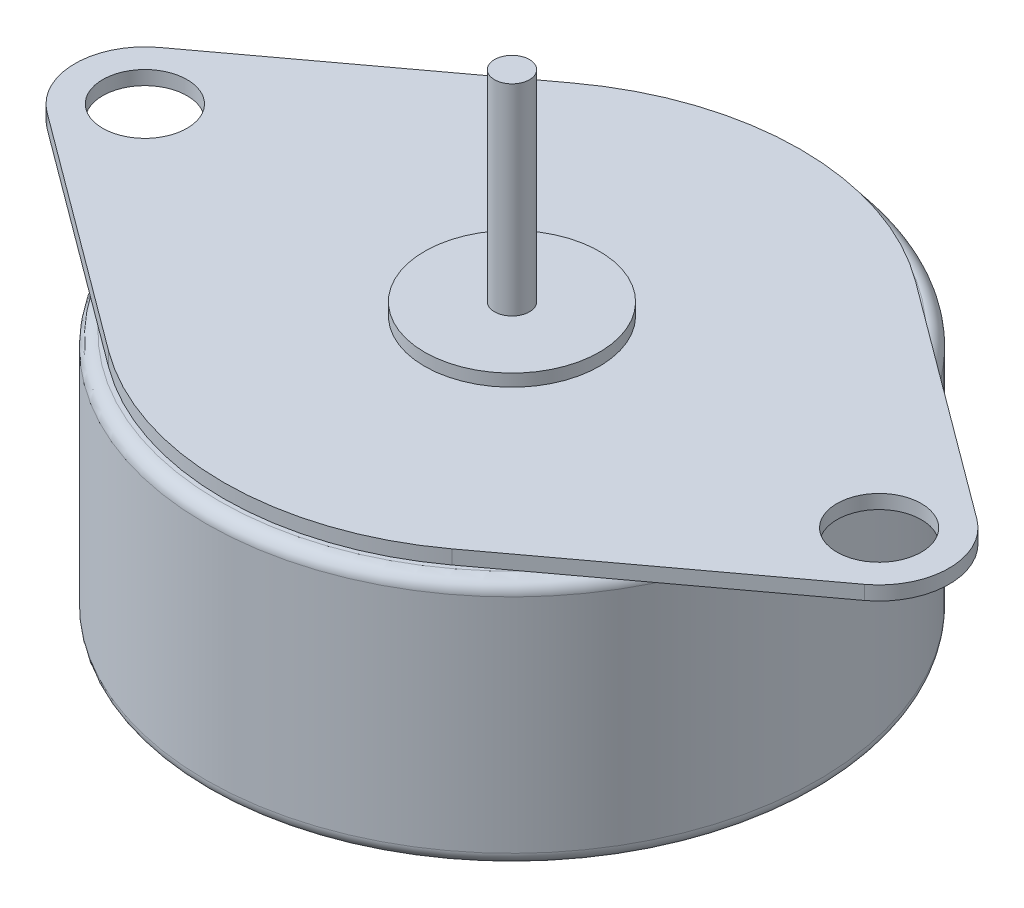
ISO-10303-21;
HEADER;
FILE_DESCRIPTION(('STEP AP214'),'2;1');
FILE_NAME('part.step','',(''),(''),'','','');
FILE_SCHEMA(('AUTOMOTIVE_DESIGN { 1 0 10303 214 1 1 1 1 }'));
ENDSEC;
DATA;
#1=APPLICATION_CONTEXT('core data for automotive mechanical design processes');
#2=APPLICATION_PROTOCOL_DEFINITION('international standard','automotive_design',2000,#1);
#3=PRODUCT_CONTEXT('',#1,'mechanical');
#4=PRODUCT('Part','Part','',(#3));
#5=PRODUCT_RELATED_PRODUCT_CATEGORY('part','',(#4));
#6=PRODUCT_DEFINITION_FORMATION('','',#4);
#7=PRODUCT_DEFINITION_CONTEXT('part definition',#1,'design');
#8=PRODUCT_DEFINITION('design','',#6,#7);
#9=PRODUCT_DEFINITION_SHAPE('','',#8);
#10=(LENGTH_UNIT() NAMED_UNIT(*) SI_UNIT(.MILLI.,.METRE.));
#11=(NAMED_UNIT(*) PLANE_ANGLE_UNIT() SI_UNIT($,.RADIAN.));
#12=(NAMED_UNIT(*) SI_UNIT($,.STERADIAN.) SOLID_ANGLE_UNIT());
#13=UNCERTAINTY_MEASURE_WITH_UNIT(LENGTH_MEASURE(1.E-05),#10,'distance_accuracy_value','');
#14=(GEOMETRIC_REPRESENTATION_CONTEXT(3) GLOBAL_UNCERTAINTY_ASSIGNED_CONTEXT((#13)) GLOBAL_UNIT_ASSIGNED_CONTEXT((#10,
#11,#12)) REPRESENTATION_CONTEXT('',''));
#15=CARTESIAN_POINT('',(0.,0.,0.));
#16=DIRECTION('',(0.,0.,1.));
#17=DIRECTION('',(1.,0.,0.));
#18=AXIS2_PLACEMENT_3D('',#15,#16,#17);
#19=CARTESIAN_POINT('',(0.,15.7,0.));
#20=DIRECTION('',(0.,1.,0.));
#21=DIRECTION('',(0.,0.,1.));
#22=AXIS2_PLACEMENT_3D('',#19,#20,#21);
#23=PLANE('',#22);
#24=CARTESIAN_POINT('',(0.,15.7,0.));
#25=DIRECTION('',(0.,1.,0.));
#26=DIRECTION('',(0.,0.,1.));
#27=AXIS2_PLACEMENT_3D('',#24,#25,#26);
#28=CIRCLE('',#27,5.);
#29=CARTESIAN_POINT('',(0.,15.7,5.));
#30=VERTEX_POINT('',#29);
#31=EDGE_CURVE('E241',#30,#30,#28,.T.);
#32=ORIENTED_EDGE('',*,*,#31,.T.);
#33=EDGE_LOOP('',(#32));
#34=FACE_BOUND('',#33,.T.);
#35=CARTESIAN_POINT('',(0.,15.7,0.));
#36=DIRECTION('',(0.,1.,0.));
#37=DIRECTION('',(0.,0.,1.));
#38=AXIS2_PLACEMENT_3D('',#35,#36,#37);
#39=CIRCLE('',#38,1.);
#40=CARTESIAN_POINT('',(0.,15.7,1.));
#41=VERTEX_POINT('',#40);
#42=EDGE_CURVE('E248',#41,#41,#39,.T.);
#43=ORIENTED_EDGE('',*,*,#42,.F.);
#44=EDGE_LOOP('',(#43));
#45=FACE_BOUND('',#44,.T.);
#46=ADVANCED_FACE('F33',(#34,#45),#23,.T.);
#47=CARTESIAN_POINT('',(-21.,15.,0.));
#48=DIRECTION('',(0.,1.,0.));
#49=DIRECTION('',(0.,0.,1.));
#50=AXIS2_PLACEMENT_3D('',#47,#48,#49);
#51=PLANE('',#50);
#52=CARTESIAN_POINT('',(21.,15.,0.));
#53=DIRECTION('',(0.,1.,0.));
#54=DIRECTION('',(0.,0.,-1.));
#55=AXIS2_PLACEMENT_3D('',#52,#53,#54);
#56=CIRCLE('',#55,2.413);
#57=CARTESIAN_POINT('',(21.,15.,-2.413));
#58=VERTEX_POINT('',#57);
#59=EDGE_CURVE('E230',#58,#58,#56,.T.);
#60=ORIENTED_EDGE('',*,*,#59,.F.);
#61=EDGE_LOOP('',(#60));
#62=FACE_BOUND('',#61,.T.);
#63=CARTESIAN_POINT('',(-21.,15.,0.));
#64=DIRECTION('',(0.,1.,0.));
#65=DIRECTION('',(0.,0.,1.));
#66=AXIS2_PLACEMENT_3D('',#63,#64,#65);
#67=CIRCLE('',#66,4.);
#68=CARTESIAN_POINT('',(-23.3809523809524,15.,-3.21419752965452));
#69=VERTEX_POINT('',#68);
#70=CARTESIAN_POINT('',(-23.3809523809524,15.,3.21419752965452));
#71=VERTEX_POINT('',#70);
#72=EDGE_CURVE('E120',#69,#71,#67,.T.);
#73=ORIENTED_EDGE('',*,*,#72,.T.);
#74=DIRECTION('',(0.803549382413629,0.,0.595238095238095));
#75=VECTOR('',#74,1.);
#76=CARTESIAN_POINT('',(-23.3809523809524,15.,3.21419752965452));
#77=LINE('',#76,#75);
#78=CARTESIAN_POINT('',(-9.82142857142858,15.,13.2585648098249));
#79=VERTEX_POINT('',#78);
#80=EDGE_CURVE('E108',#71,#79,#77,.T.);
#81=ORIENTED_EDGE('',*,*,#80,.T.);
#82=CARTESIAN_POINT('',(0.,15.,0.));
#83=DIRECTION('',(0.,1.,0.));
#84=DIRECTION('',(0.,0.,1.));
#85=AXIS2_PLACEMENT_3D('',#82,#83,#84);
#86=CIRCLE('',#85,16.5);
#87=CARTESIAN_POINT('',(9.82142857142857,15.,13.2585648098249));
#88=VERTEX_POINT('',#87);
#89=EDGE_CURVE('E119',#79,#88,#86,.T.);
#90=ORIENTED_EDGE('',*,*,#89,.T.);
#91=DIRECTION('',(0.803549382413629,0.,-0.595238095238095));
#92=VECTOR('',#91,1.);
#93=CARTESIAN_POINT('',(23.3809523809524,15.,3.21419752965452));
#94=LINE('',#93,#92);
#95=CARTESIAN_POINT('',(23.3809523809524,15.,3.21419752965452));
#96=VERTEX_POINT('',#95);
#97=EDGE_CURVE('E204',#88,#96,#94,.T.);
#98=ORIENTED_EDGE('',*,*,#97,.T.);
#99=CARTESIAN_POINT('',(21.,15.,0.));
#100=DIRECTION('',(0.,1.,0.));
#101=DIRECTION('',(0.,0.,-1.));
#102=AXIS2_PLACEMENT_3D('',#99,#100,#101);
#103=CIRCLE('',#102,4.);
#104=CARTESIAN_POINT('',(23.3809523809524,15.,-3.21419752965452));
#105=VERTEX_POINT('',#104);
#106=EDGE_CURVE('E208',#96,#105,#103,.T.);
#107=ORIENTED_EDGE('',*,*,#106,.T.);
#108=DIRECTION('',(-0.803549382413629,0.,-0.595238095238095));
#109=VECTOR('',#108,1.);
#110=CARTESIAN_POINT('',(23.3809523809524,15.,-3.21419752965452));
#111=LINE('',#110,#109);
#112=CARTESIAN_POINT('',(9.82142857142857,15.,-13.2585648098249));
#113=VERTEX_POINT('',#112);
#114=EDGE_CURVE('E212',#105,#113,#111,.T.);
#115=ORIENTED_EDGE('',*,*,#114,.T.);
#116=CARTESIAN_POINT('',(0.,15.,0.));
#117=DIRECTION('',(0.,1.,0.));
#118=DIRECTION('',(0.,0.,1.));
#119=AXIS2_PLACEMENT_3D('',#116,#117,#118);
#120=CIRCLE('',#119,16.5);
#121=CARTESIAN_POINT('',(-9.82142857142857,15.,-13.2585648098249));
#122=VERTEX_POINT('',#121);
#123=EDGE_CURVE('E214',#113,#122,#120,.T.);
#124=ORIENTED_EDGE('',*,*,#123,.T.);
#125=DIRECTION('',(-0.803549382413629,0.,0.595238095238095));
#126=VECTOR('',#125,1.);
#127=CARTESIAN_POINT('',(-23.3809523809524,15.,-3.21419752965452));
#128=LINE('',#127,#126);
#129=EDGE_CURVE('E126',#122,#69,#128,.T.);
#130=ORIENTED_EDGE('',*,*,#129,.T.);
#131=EDGE_LOOP('',(#73,#81,#90,#98,#107,#115,#124,#130));
#132=FACE_BOUND('',#131,.T.);
#133=CARTESIAN_POINT('',(-21.,15.,0.));
#134=DIRECTION('',(0.,1.,0.));
#135=DIRECTION('',(0.,0.,1.));
#136=AXIS2_PLACEMENT_3D('',#133,#134,#135);
#137=CIRCLE('',#136,2.413);
#138=CARTESIAN_POINT('',(-21.,15.,2.413));
#139=VERTEX_POINT('',#138);
#140=EDGE_CURVE('E223',#139,#139,#137,.T.);
#141=ORIENTED_EDGE('',*,*,#140,.F.);
#142=EDGE_LOOP('',(#141));
#143=FACE_BOUND('',#142,.T.);
#144=CARTESIAN_POINT('',(0.,15.,0.));
#145=DIRECTION('',(0.,1.,0.));
#146=DIRECTION('',(0.,0.,1.));
#147=AXIS2_PLACEMENT_3D('',#144,#145,#146);
#148=CIRCLE('',#147,5.);
#149=CARTESIAN_POINT('',(0.,15.,5.));
#150=VERTEX_POINT('',#149);
#151=EDGE_CURVE('E242',#150,#150,#148,.T.);
#152=ORIENTED_EDGE('',*,*,#151,.F.);
#153=EDGE_LOOP('',(#152));
#154=FACE_BOUND('',#153,.T.);
#155=ADVANCED_FACE('F123',(#62,#132,#143,#154),#51,.T.);
#156=CARTESIAN_POINT('',(0.,0.,0.));
#157=DIRECTION('',(0.,1.,0.));
#158=DIRECTION('',(0.,0.,1.));
#159=AXIS2_PLACEMENT_3D('',#156,#157,#158);
#160=PLANE('',#159);
#161=CARTESIAN_POINT('',(0.,0.,0.));
#162=DIRECTION('',(0.,1.,0.));
#163=DIRECTION('',(0.,0.,1.));
#164=AXIS2_PLACEMENT_3D('',#161,#162,#163);
#165=CIRCLE('',#164,16.75);
#166=CARTESIAN_POINT('',(0.,0.,16.75));
#167=VERTEX_POINT('',#166);
#168=EDGE_CURVE('E146',#167,#167,#165,.F.);
#169=ORIENTED_EDGE('',*,*,#168,.T.);
#170=EDGE_LOOP('',(#169));
#171=FACE_BOUND('',#170,.T.);
#172=CARTESIAN_POINT('',(0.,0.,0.));
#173=DIRECTION('',(0.,1.,0.));
#174=DIRECTION('',(0.,0.,1.));
#175=AXIS2_PLACEMENT_3D('',#172,#173,#174);
#176=CIRCLE('',#175,5.);
#177=CARTESIAN_POINT('',(0.,0.,5.));
#178=VERTEX_POINT('',#177);
#179=EDGE_CURVE('E11',#178,#178,#176,.F.);
#180=ORIENTED_EDGE('',*,*,#179,.F.);
#181=EDGE_LOOP('',(#180));
#182=FACE_BOUND('',#181,.T.);
#183=ADVANCED_FACE('F269',(#171,#182),#160,.F.);
#184=CARTESIAN_POINT('',(0.,14.2,0.));
#185=DIRECTION('',(0.,1.,0.));
#186=DIRECTION('',(0.,0.,1.));
#187=AXIS2_PLACEMENT_3D('',#184,#185,#186);
#188=PLANE('',#187);
#189=CARTESIAN_POINT('',(0.,14.2,0.));
#190=DIRECTION('',(0.,1.,0.));
#191=DIRECTION('',(0.,0.,1.));
#192=AXIS2_PLACEMENT_3D('',#189,#190,#191);
#193=CIRCLE('',#192,16.5);
#194=CARTESIAN_POINT('',(-9.82142857142858,14.2,13.2585648098249));
#195=VERTEX_POINT('',#194);
#196=CARTESIAN_POINT('',(9.82142857142857,14.2,13.2585648098249));
#197=VERTEX_POINT('',#196);
#198=EDGE_CURVE('E48',#195,#197,#193,.T.);
#199=ORIENTED_EDGE('',*,*,#198,.F.);
#200=DIRECTION('',(0.803549382413629,0.,0.595238095238095));
#201=VECTOR('',#200,1.);
#202=CARTESIAN_POINT('',(-23.3809523809524,14.2,3.21419752965452));
#203=LINE('',#202,#201);
#204=CARTESIAN_POINT('',(-12.1381744590771,14.2,11.5424096618084));
#205=VERTEX_POINT('',#204);
#206=EDGE_CURVE('E168',#205,#195,#203,.T.);
#207=ORIENTED_EDGE('',*,*,#206,.F.);
#208=CARTESIAN_POINT('',(0.,14.2,0.));
#209=DIRECTION('',(0.,1.,0.));
#210=DIRECTION('',(0.,0.,1.));
#211=AXIS2_PLACEMENT_3D('',#208,#209,#210);
#212=CIRCLE('',#211,16.75);
#213=CARTESIAN_POINT('',(12.1381744590771,14.2,11.5424096618084));
#214=VERTEX_POINT('',#213);
#215=EDGE_CURVE('E148',#205,#214,#212,.T.);
#216=ORIENTED_EDGE('',*,*,#215,.T.);
#217=DIRECTION('',(0.803549382413629,0.,-0.595238095238095));
#218=VECTOR('',#217,1.);
#219=CARTESIAN_POINT('',(23.3809523809524,14.2,3.21419752965452));
#220=LINE('',#219,#218);
#221=EDGE_CURVE('E53',#197,#214,#220,.T.);
#222=ORIENTED_EDGE('',*,*,#221,.F.);
#223=EDGE_LOOP('',(#199,#207,#216,#222));
#224=FACE_BOUND('',#223,.T.);
#225=ADVANCED_FACE('F315',(#224),#188,.T.);
#226=CARTESIAN_POINT('',(0.,14.2,0.));
#227=DIRECTION('',(0.,1.,0.));
#228=DIRECTION('',(0.,0.,1.));
#229=AXIS2_PLACEMENT_3D('',#226,#227,#228);
#230=CIRCLE('',#229,16.5);
#231=CARTESIAN_POINT('',(9.82142857142857,14.2,-13.2585648098249));
#232=VERTEX_POINT('',#231);
#233=CARTESIAN_POINT('',(-9.82142857142857,14.2,-13.2585648098249));
#234=VERTEX_POINT('',#233);
#235=EDGE_CURVE('E181',#232,#234,#230,.T.);
#236=ORIENTED_EDGE('',*,*,#235,.F.);
#237=DIRECTION('',(-0.803549382413629,0.,-0.595238095238095));
#238=VECTOR('',#237,1.);
#239=CARTESIAN_POINT('',(23.3809523809524,14.2,-3.21419752965452));
#240=LINE('',#239,#238);
#241=CARTESIAN_POINT('',(12.1381744590869,14.2,-11.5424096618012));
#242=VERTEX_POINT('',#241);
#243=EDGE_CURVE('E178',#242,#232,#240,.T.);
#244=ORIENTED_EDGE('',*,*,#243,.F.);
#245=CARTESIAN_POINT('',(-12.1381744590771,14.2,-11.5424096618084));
#246=VERTEX_POINT('',#245);
#247=EDGE_CURVE('E150',#242,#246,#212,.T.);
#248=ORIENTED_EDGE('',*,*,#247,.T.);
#249=DIRECTION('',(-0.803549382413629,0.,0.595238095238095));
#250=VECTOR('',#249,1.);
#251=CARTESIAN_POINT('',(-23.3809523809524,14.2,-3.21419752965452));
#252=LINE('',#251,#250);
#253=EDGE_CURVE('E130',#234,#246,#252,.T.);
#254=ORIENTED_EDGE('',*,*,#253,.F.);
#255=EDGE_LOOP('',(#236,#244,#248,#254));
#256=FACE_BOUND('',#255,.T.);
#257=ADVANCED_FACE('F318',(#256),#188,.T.);
#258=CARTESIAN_POINT('',(0.,14.2,0.));
#259=DIRECTION('',(0.,-1.,0.));
#260=DIRECTION('',(0.,0.,-1.));
#261=AXIS2_PLACEMENT_3D('',#258,#259,#260);
#262=CYLINDRICAL_SURFACE('',#261,17.5);
#263=CARTESIAN_POINT('',(0.,0.750000000000001,0.));
#264=DIRECTION('',(0.,1.,0.));
#265=DIRECTION('',(0.,0.,1.));
#266=AXIS2_PLACEMENT_3D('',#263,#264,#265);
#267=CIRCLE('',#266,17.5);
#268=CARTESIAN_POINT('',(0.,0.750000000000001,17.5));
#269=VERTEX_POINT('',#268);
#270=EDGE_CURVE('E138',#269,#269,#267,.T.);
#271=ORIENTED_EDGE('',*,*,#270,.T.);
#272=EDGE_LOOP('',(#271));
#273=FACE_BOUND('',#272,.T.);
#274=CARTESIAN_POINT('',(0.,13.45,0.));
#275=DIRECTION('',(0.,1.,0.));
#276=DIRECTION('',(0.,0.,1.));
#277=AXIS2_PLACEMENT_3D('',#274,#275,#276);
#278=CIRCLE('',#277,17.5);
#279=CARTESIAN_POINT('',(0.,13.45,17.5));
#280=VERTEX_POINT('',#279);
#281=EDGE_CURVE('E135',#280,#280,#278,.F.);
#282=ORIENTED_EDGE('',*,*,#281,.T.);
#283=EDGE_LOOP('',(#282));
#284=FACE_BOUND('',#283,.T.);
#285=ADVANCED_FACE('F322',(#273,#284),#262,.T.);
#286=CARTESIAN_POINT('',(0.,0.750000000000001,0.));
#287=DIRECTION('',(0.,1.,0.));
#288=DIRECTION('',(0.,0.,1.));
#289=AXIS2_PLACEMENT_3D('',#286,#287,#288);
#290=TOROIDAL_SURFACE('',#289,16.75,0.75);
#291=ORIENTED_EDGE('',*,*,#168,.F.);
#292=EDGE_LOOP('',(#291));
#293=FACE_BOUND('',#292,.T.);
#294=ORIENTED_EDGE('',*,*,#270,.F.);
#295=EDGE_LOOP('',(#294));
#296=FACE_BOUND('',#295,.T.);
#297=ADVANCED_FACE('F324',(#293,#296),#290,.T.);
#298=CARTESIAN_POINT('',(0.,13.45,0.));
#299=DIRECTION('',(0.,1.,0.));
#300=DIRECTION('',(0.,0.,1.));
#301=AXIS2_PLACEMENT_3D('',#298,#299,#300);
#302=TOROIDAL_SURFACE('',#301,16.75,0.75);
#303=ORIENTED_EDGE('',*,*,#281,.F.);
#304=EDGE_LOOP('',(#303));
#305=FACE_BOUND('',#304,.T.);
#306=EDGE_CURVE('E41',#214,#242,#212,.T.);
#307=ORIENTED_EDGE('',*,*,#306,.F.);
#308=ORIENTED_EDGE('',*,*,#215,.F.);
#309=EDGE_CURVE('E157',#246,#205,#212,.T.);
#310=ORIENTED_EDGE('',*,*,#309,.F.);
#311=ORIENTED_EDGE('',*,*,#247,.F.);
#312=EDGE_LOOP('',(#307,#308,#310,#311));
#313=FACE_BOUND('',#312,.T.);
#314=ADVANCED_FACE('F35',(#305,#313),#302,.T.);
#315=CARTESIAN_POINT('',(-21.,14.2,0.));
#316=DIRECTION('',(0.,1.,0.));
#317=DIRECTION('',(0.,0.,1.));
#318=AXIS2_PLACEMENT_3D('',#315,#316,#317);
#319=PLANE('',#318);
#320=ORIENTED_EDGE('',*,*,#309,.T.);
#321=CARTESIAN_POINT('',(-23.3809523809524,14.2,3.21419752965452));
#322=VERTEX_POINT('',#321);
#323=EDGE_CURVE('E164',#322,#205,#203,.T.);
#324=ORIENTED_EDGE('',*,*,#323,.F.);
#325=CARTESIAN_POINT('',(-21.,14.2,0.));
#326=DIRECTION('',(0.,1.,0.));
#327=DIRECTION('',(0.,0.,1.));
#328=AXIS2_PLACEMENT_3D('',#325,#326,#327);
#329=CIRCLE('',#328,4.);
#330=CARTESIAN_POINT('',(-23.3809523809524,14.2,-3.21419752965452));
#331=VERTEX_POINT('',#330);
#332=EDGE_CURVE('E134',#331,#322,#329,.T.);
#333=ORIENTED_EDGE('',*,*,#332,.F.);
#334=EDGE_CURVE('E165',#246,#331,#252,.T.);
#335=ORIENTED_EDGE('',*,*,#334,.F.);
#336=EDGE_LOOP('',(#320,#324,#333,#335));
#337=FACE_BOUND('',#336,.T.);
#338=CARTESIAN_POINT('',(-21.,14.2,0.));
#339=DIRECTION('',(0.,1.,0.));
#340=DIRECTION('',(0.,0.,1.));
#341=AXIS2_PLACEMENT_3D('',#338,#339,#340);
#342=CIRCLE('',#341,2.413);
#343=CARTESIAN_POINT('',(-21.,14.2,2.413));
#344=VERTEX_POINT('',#343);
#345=EDGE_CURVE('E225',#344,#344,#342,.T.);
#346=ORIENTED_EDGE('',*,*,#345,.T.);
#347=EDGE_LOOP('',(#346));
#348=FACE_BOUND('',#347,.T.);
#349=ADVANCED_FACE('F162',(#337,#348),#319,.F.);
#350=ORIENTED_EDGE('',*,*,#306,.T.);
#351=CARTESIAN_POINT('',(23.3809523809524,14.2,-3.21419752965452));
#352=VERTEX_POINT('',#351);
#353=EDGE_CURVE('E179',#352,#242,#240,.T.);
#354=ORIENTED_EDGE('',*,*,#353,.F.);
#355=CARTESIAN_POINT('',(21.,14.2,0.));
#356=DIRECTION('',(0.,1.,0.));
#357=DIRECTION('',(0.,0.,-1.));
#358=AXIS2_PLACEMENT_3D('',#355,#356,#357);
#359=CIRCLE('',#358,4.);
#360=CARTESIAN_POINT('',(23.3809523809524,14.2,3.21419752965452));
#361=VERTEX_POINT('',#360);
#362=EDGE_CURVE('E176',#361,#352,#359,.T.);
#363=ORIENTED_EDGE('',*,*,#362,.F.);
#364=EDGE_CURVE('E170',#214,#361,#220,.T.);
#365=ORIENTED_EDGE('',*,*,#364,.F.);
#366=EDGE_LOOP('',(#350,#354,#363,#365));
#367=FACE_BOUND('',#366,.T.);
#368=CARTESIAN_POINT('',(21.,14.2,0.));
#369=DIRECTION('',(0.,1.,0.));
#370=DIRECTION('',(0.,0.,-1.));
#371=AXIS2_PLACEMENT_3D('',#368,#369,#370);
#372=CIRCLE('',#371,2.413);
#373=CARTESIAN_POINT('',(21.,14.2,-2.413));
#374=VERTEX_POINT('',#373);
#375=EDGE_CURVE('E233',#374,#374,#372,.T.);
#376=ORIENTED_EDGE('',*,*,#375,.T.);
#377=EDGE_LOOP('',(#376));
#378=FACE_BOUND('',#377,.T.);
#379=ADVANCED_FACE('F292',(#367,#378),#319,.F.);
#380=CARTESIAN_POINT('',(-21.,15.,0.));
#381=DIRECTION('',(0.,-1.,0.));
#382=DIRECTION('',(0.,0.,-1.));
#383=AXIS2_PLACEMENT_3D('',#380,#381,#382);
#384=CYLINDRICAL_SURFACE('',#383,4.);
#385=ORIENTED_EDGE('',*,*,#332,.T.);
#386=DIRECTION('',(0.,-1.,0.));
#387=VECTOR('',#386,1.);
#388=CARTESIAN_POINT('',(-23.3809523809524,15.,3.21419752965452));
#389=LINE('',#388,#387);
#390=EDGE_CURVE('E113',#71,#322,#389,.T.);
#391=ORIENTED_EDGE('',*,*,#390,.F.);
#392=ORIENTED_EDGE('',*,*,#72,.F.);
#393=DIRECTION('',(0.,-1.,0.));
#394=VECTOR('',#393,1.);
#395=CARTESIAN_POINT('',(-23.3809523809524,15.,-3.21419752965452));
#396=LINE('',#395,#394);
#397=EDGE_CURVE('E185',#69,#331,#396,.T.);
#398=ORIENTED_EDGE('',*,*,#397,.T.);
#399=EDGE_LOOP('',(#385,#391,#392,#398));
#400=FACE_BOUND('',#399,.T.);
#401=ADVANCED_FACE('F132',(#400),#384,.T.);
#402=CARTESIAN_POINT('',(-23.3809523809524,15.,3.21419752965452));
#403=DIRECTION('',(0.595238095238095,0.,-0.803549382413629));
#404=DIRECTION('',(-0.803549382413629,0.,-0.595238095238095));
#405=AXIS2_PLACEMENT_3D('',#402,#403,#404);
#406=PLANE('',#405);
#407=ORIENTED_EDGE('',*,*,#323,.T.);
#408=ORIENTED_EDGE('',*,*,#206,.T.);
#409=DIRECTION('',(0.,-1.,0.));
#410=VECTOR('',#409,1.);
#411=CARTESIAN_POINT('',(-9.82142857142858,15.,13.2585648098249));
#412=LINE('',#411,#410);
#413=EDGE_CURVE('E116',#79,#195,#412,.T.);
#414=ORIENTED_EDGE('',*,*,#413,.F.);
#415=ORIENTED_EDGE('',*,*,#80,.F.);
#416=ORIENTED_EDGE('',*,*,#390,.T.);
#417=EDGE_LOOP('',(#407,#408,#414,#415,#416));
#418=FACE_BOUND('',#417,.T.);
#419=ADVANCED_FACE('F111',(#418),#406,.F.);
#420=CARTESIAN_POINT('',(0.,15.,0.));
#421=DIRECTION('',(0.,-1.,0.));
#422=DIRECTION('',(0.,0.,-1.));
#423=AXIS2_PLACEMENT_3D('',#420,#421,#422);
#424=CYLINDRICAL_SURFACE('',#423,16.5);
#425=ORIENTED_EDGE('',*,*,#198,.T.);
#426=DIRECTION('',(0.,-1.,0.));
#427=VECTOR('',#426,1.);
#428=CARTESIAN_POINT('',(9.82142857142857,15.,13.2585648098249));
#429=LINE('',#428,#427);
#430=EDGE_CURVE('E140',#88,#197,#429,.T.);
#431=ORIENTED_EDGE('',*,*,#430,.F.);
#432=ORIENTED_EDGE('',*,*,#89,.F.);
#433=ORIENTED_EDGE('',*,*,#413,.T.);
#434=EDGE_LOOP('',(#425,#431,#432,#433));
#435=FACE_BOUND('',#434,.T.);
#436=ADVANCED_FACE('F206',(#435),#424,.T.);
#437=CARTESIAN_POINT('',(23.3809523809524,15.,3.21419752965452));
#438=DIRECTION('',(-0.595238095238095,0.,-0.803549382413629));
#439=DIRECTION('',(-0.803549382413629,0.,0.595238095238095));
#440=AXIS2_PLACEMENT_3D('',#437,#438,#439);
#441=PLANE('',#440);
#442=ORIENTED_EDGE('',*,*,#221,.T.);
#443=ORIENTED_EDGE('',*,*,#364,.T.);
#444=DIRECTION('',(0.,-1.,0.));
#445=VECTOR('',#444,1.);
#446=CARTESIAN_POINT('',(23.3809523809524,15.,3.21419752965452));
#447=LINE('',#446,#445);
#448=EDGE_CURVE('E196',#96,#361,#447,.T.);
#449=ORIENTED_EDGE('',*,*,#448,.F.);
#450=ORIENTED_EDGE('',*,*,#97,.F.);
#451=ORIENTED_EDGE('',*,*,#430,.T.);
#452=EDGE_LOOP('',(#442,#443,#449,#450,#451));
#453=FACE_BOUND('',#452,.T.);
#454=ADVANCED_FACE('F202',(#453),#441,.F.);
#455=CARTESIAN_POINT('',(21.,15.,0.));
#456=DIRECTION('',(0.,-1.,0.));
#457=DIRECTION('',(0.,0.,-1.));
#458=AXIS2_PLACEMENT_3D('',#455,#456,#457);
#459=CYLINDRICAL_SURFACE('',#458,4.);
#460=ORIENTED_EDGE('',*,*,#362,.T.);
#461=DIRECTION('',(0.,-1.,0.));
#462=VECTOR('',#461,1.);
#463=CARTESIAN_POINT('',(23.3809523809524,15.,-3.21419752965452));
#464=LINE('',#463,#462);
#465=EDGE_CURVE('E193',#105,#352,#464,.T.);
#466=ORIENTED_EDGE('',*,*,#465,.F.);
#467=ORIENTED_EDGE('',*,*,#106,.F.);
#468=ORIENTED_EDGE('',*,*,#448,.T.);
#469=EDGE_LOOP('',(#460,#466,#467,#468));
#470=FACE_BOUND('',#469,.T.);
#471=ADVANCED_FACE('F302',(#470),#459,.T.);
#472=CARTESIAN_POINT('',(23.3809523809524,15.,-3.21419752965452));
#473=DIRECTION('',(-0.595238095238095,0.,0.803549382413629));
#474=DIRECTION('',(0.803549382413629,0.,0.595238095238095));
#475=AXIS2_PLACEMENT_3D('',#472,#473,#474);
#476=PLANE('',#475);
#477=ORIENTED_EDGE('',*,*,#353,.T.);
#478=ORIENTED_EDGE('',*,*,#243,.T.);
#479=DIRECTION('',(0.,-1.,0.));
#480=VECTOR('',#479,1.);
#481=CARTESIAN_POINT('',(9.82142857142857,15.,-13.2585648098249));
#482=LINE('',#481,#480);
#483=EDGE_CURVE('E190',#113,#232,#482,.T.);
#484=ORIENTED_EDGE('',*,*,#483,.F.);
#485=ORIENTED_EDGE('',*,*,#114,.F.);
#486=ORIENTED_EDGE('',*,*,#465,.T.);
#487=EDGE_LOOP('',(#477,#478,#484,#485,#486));
#488=FACE_BOUND('',#487,.T.);
#489=ADVANCED_FACE('F299',(#488),#476,.F.);
#490=CARTESIAN_POINT('',(0.,15.,0.));
#491=DIRECTION('',(0.,-1.,0.));
#492=DIRECTION('',(0.,0.,-1.));
#493=AXIS2_PLACEMENT_3D('',#490,#491,#492);
#494=CYLINDRICAL_SURFACE('',#493,16.5);
#495=ORIENTED_EDGE('',*,*,#235,.T.);
#496=DIRECTION('',(0.,-1.,0.));
#497=VECTOR('',#496,1.);
#498=CARTESIAN_POINT('',(-9.82142857142857,15.,-13.2585648098249));
#499=LINE('',#498,#497);
#500=EDGE_CURVE('E187',#122,#234,#499,.T.);
#501=ORIENTED_EDGE('',*,*,#500,.F.);
#502=ORIENTED_EDGE('',*,*,#123,.F.);
#503=ORIENTED_EDGE('',*,*,#483,.T.);
#504=EDGE_LOOP('',(#495,#501,#502,#503));
#505=FACE_BOUND('',#504,.T.);
#506=ADVANCED_FACE('F220',(#505),#494,.T.);
#507=CARTESIAN_POINT('',(-23.3809523809524,15.,-3.21419752965452));
#508=DIRECTION('',(0.595238095238095,0.,0.803549382413629));
#509=DIRECTION('',(0.803549382413629,0.,-0.595238095238095));
#510=AXIS2_PLACEMENT_3D('',#507,#508,#509);
#511=PLANE('',#510);
#512=ORIENTED_EDGE('',*,*,#253,.T.);
#513=ORIENTED_EDGE('',*,*,#334,.T.);
#514=ORIENTED_EDGE('',*,*,#397,.F.);
#515=ORIENTED_EDGE('',*,*,#129,.F.);
#516=ORIENTED_EDGE('',*,*,#500,.T.);
#517=EDGE_LOOP('',(#512,#513,#514,#515,#516));
#518=FACE_BOUND('',#517,.T.);
#519=ADVANCED_FACE('F222',(#518),#511,.F.);
#520=CARTESIAN_POINT('',(-21.,15.,0.));
#521=DIRECTION('',(0.,-1.,0.));
#522=DIRECTION('',(0.,0.,-1.));
#523=AXIS2_PLACEMENT_3D('',#520,#521,#522);
#524=CYLINDRICAL_SURFACE('',#523,2.413);
#525=ORIENTED_EDGE('',*,*,#140,.T.);
#526=EDGE_LOOP('',(#525));
#527=FACE_BOUND('',#526,.T.);
#528=ORIENTED_EDGE('',*,*,#345,.F.);
#529=EDGE_LOOP('',(#528));
#530=FACE_BOUND('',#529,.T.);
#531=ADVANCED_FACE('F288',(#527,#530),#524,.F.);
#532=CARTESIAN_POINT('',(21.,15.,0.));
#533=DIRECTION('',(0.,-1.,0.));
#534=DIRECTION('',(0.,0.,-1.));
#535=AXIS2_PLACEMENT_3D('',#532,#533,#534);
#536=CYLINDRICAL_SURFACE('',#535,2.413);
#537=ORIENTED_EDGE('',*,*,#59,.T.);
#538=EDGE_LOOP('',(#537));
#539=FACE_BOUND('',#538,.T.);
#540=ORIENTED_EDGE('',*,*,#375,.F.);
#541=EDGE_LOOP('',(#540));
#542=FACE_BOUND('',#541,.T.);
#543=ADVANCED_FACE('F284',(#539,#542),#536,.F.);
#544=CARTESIAN_POINT('',(0.,-2.,0.));
#545=DIRECTION('',(0.,1.,0.));
#546=DIRECTION('',(0.,0.,1.));
#547=AXIS2_PLACEMENT_3D('',#544,#545,#546);
#548=CYLINDRICAL_SURFACE('',#547,5.);
#549=CARTESIAN_POINT('',(0.,-2.,0.));
#550=DIRECTION('',(0.,-1.,0.));
#551=DIRECTION('',(0.,0.,-1.));
#552=AXIS2_PLACEMENT_3D('',#549,#550,#551);
#553=CIRCLE('',#552,5.);
#554=CARTESIAN_POINT('',(0.,-2.,-5.));
#555=VERTEX_POINT('',#554);
#556=EDGE_CURVE('E236',#555,#555,#553,.T.);
#557=ORIENTED_EDGE('',*,*,#556,.F.);
#558=EDGE_LOOP('',(#557));
#559=FACE_BOUND('',#558,.T.);
#560=ORIENTED_EDGE('',*,*,#179,.T.);
#561=EDGE_LOOP('',(#560));
#562=FACE_BOUND('',#561,.T.);
#563=ADVANCED_FACE('F280',(#559,#562),#548,.T.);
#564=CARTESIAN_POINT('',(0.,-2.,0.));
#565=DIRECTION('',(0.,-1.,0.));
#566=DIRECTION('',(0.,0.,-1.));
#567=AXIS2_PLACEMENT_3D('',#564,#565,#566);
#568=PLANE('',#567);
#569=ORIENTED_EDGE('',*,*,#556,.T.);
#570=EDGE_LOOP('',(#569));
#571=FACE_BOUND('',#570,.T.);
#572=ADVANCED_FACE('F276',(#571),#568,.T.);
#573=CARTESIAN_POINT('',(0.,15.7,0.));
#574=DIRECTION('',(0.,-1.,0.));
#575=DIRECTION('',(0.,0.,-1.));
#576=AXIS2_PLACEMENT_3D('',#573,#574,#575);
#577=CYLINDRICAL_SURFACE('',#576,5.);
#578=ORIENTED_EDGE('',*,*,#31,.F.);
#579=EDGE_LOOP('',(#578));
#580=FACE_BOUND('',#579,.T.);
#581=ORIENTED_EDGE('',*,*,#151,.T.);
#582=EDGE_LOOP('',(#581));
#583=FACE_BOUND('',#582,.T.);
#584=ADVANCED_FACE('F259',(#580,#583),#577,.T.);
#585=CARTESIAN_POINT('',(0.,27.2,0.));
#586=DIRECTION('',(0.,-1.,0.));
#587=DIRECTION('',(0.,0.,-1.));
#588=AXIS2_PLACEMENT_3D('',#585,#586,#587);
#589=CYLINDRICAL_SURFACE('',#588,1.);
#590=CARTESIAN_POINT('',(0.,27.2,0.));
#591=DIRECTION('',(0.,1.,0.));
#592=DIRECTION('',(0.,0.,1.));
#593=AXIS2_PLACEMENT_3D('',#590,#591,#592);
#594=CIRCLE('',#593,1.);
#595=CARTESIAN_POINT('',(0.,27.2,1.));
#596=VERTEX_POINT('',#595);
#597=EDGE_CURVE('E245',#596,#596,#594,.T.);
#598=ORIENTED_EDGE('',*,*,#597,.F.);
#599=EDGE_LOOP('',(#598));
#600=FACE_BOUND('',#599,.T.);
#601=ORIENTED_EDGE('',*,*,#42,.T.);
#602=EDGE_LOOP('',(#601));
#603=FACE_BOUND('',#602,.T.);
#604=ADVANCED_FACE('F256',(#600,#603),#589,.T.);
#605=CARTESIAN_POINT('',(0.,27.2,0.));
#606=DIRECTION('',(0.,1.,0.));
#607=DIRECTION('',(0.,0.,1.));
#608=AXIS2_PLACEMENT_3D('',#605,#606,#607);
#609=PLANE('',#608);
#610=ORIENTED_EDGE('',*,*,#597,.T.);
#611=EDGE_LOOP('',(#610));
#612=FACE_BOUND('',#611,.T.);
#613=ADVANCED_FACE('F254',(#612),#609,.T.);
#614=CLOSED_SHELL('',(#46,#155,#183,#225,#257,#285,#297,#314,#349,#379,#401,#419,#436,#454,#471,
#489,#506,#519,#531,#543,#563,#572,#584,#604,#613));
#615=MANIFOLD_SOLID_BREP('B2',#614);
#616=ADVANCED_BREP_SHAPE_REPRESENTATION('',(#18,#615),#14);
#617=SHAPE_DEFINITION_REPRESENTATION(#9,#616);
ENDSEC;
END-ISO-10303-21;
